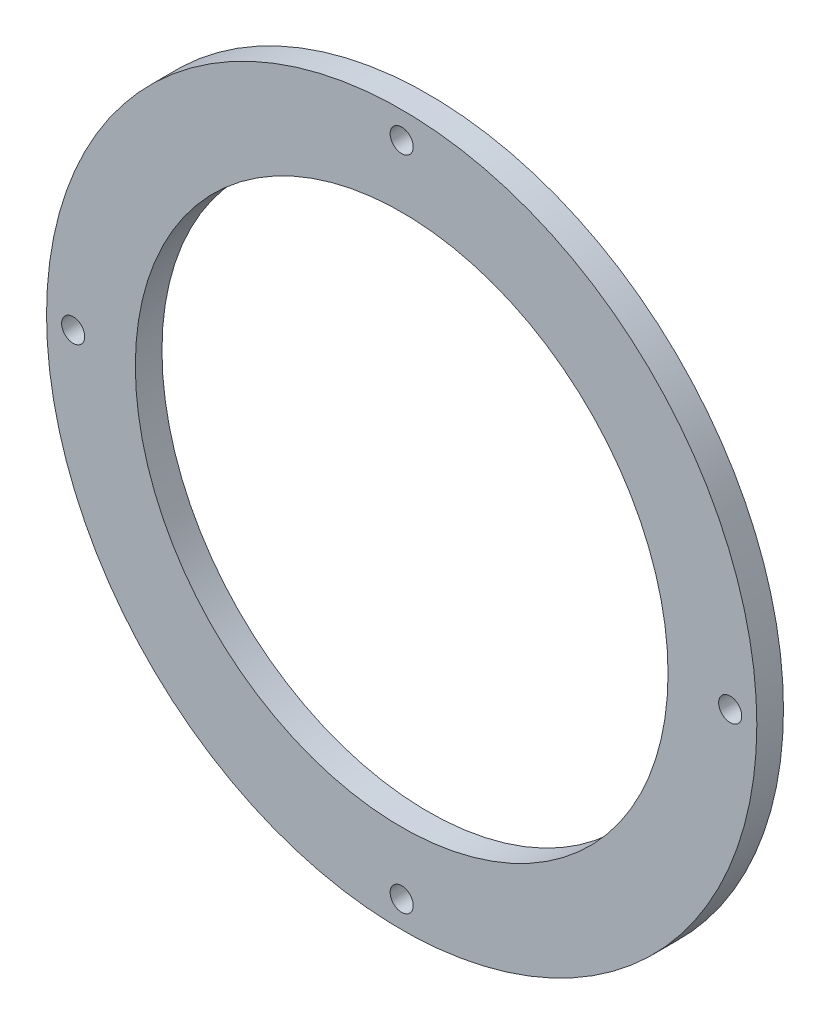
ISO-10303-21;
HEADER;
FILE_DESCRIPTION(('STEP AP214'),'2;1');
FILE_NAME('part.step','',(''),(''),'','','');
FILE_SCHEMA(('AUTOMOTIVE_DESIGN { 1 0 10303 214 1 1 1 1 }'));
ENDSEC;
DATA;
#1=APPLICATION_CONTEXT('core data for automotive mechanical design processes');
#2=APPLICATION_PROTOCOL_DEFINITION('international standard','automotive_design',2000,#1);
#3=PRODUCT_CONTEXT('',#1,'mechanical');
#4=PRODUCT('Part','Part','',(#3));
#5=PRODUCT_RELATED_PRODUCT_CATEGORY('part','',(#4));
#6=PRODUCT_DEFINITION_FORMATION('','',#4);
#7=PRODUCT_DEFINITION_CONTEXT('part definition',#1,'design');
#8=PRODUCT_DEFINITION('design','',#6,#7);
#9=PRODUCT_DEFINITION_SHAPE('','',#8);
#10=(LENGTH_UNIT() NAMED_UNIT(*) SI_UNIT(.MILLI.,.METRE.));
#11=(NAMED_UNIT(*) PLANE_ANGLE_UNIT() SI_UNIT($,.RADIAN.));
#12=(NAMED_UNIT(*) SI_UNIT($,.STERADIAN.) SOLID_ANGLE_UNIT());
#13=UNCERTAINTY_MEASURE_WITH_UNIT(LENGTH_MEASURE(1.E-05),#10,'distance_accuracy_value','');
#14=(GEOMETRIC_REPRESENTATION_CONTEXT(3) GLOBAL_UNCERTAINTY_ASSIGNED_CONTEXT((#13)) GLOBAL_UNIT_ASSIGNED_CONTEXT((#10,
#11,#12)) REPRESENTATION_CONTEXT('',''));
#15=CARTESIAN_POINT('',(0.,0.,0.));
#16=DIRECTION('',(0.,0.,1.));
#17=DIRECTION('',(1.,0.,0.));
#18=AXIS2_PLACEMENT_3D('',#15,#16,#17);
#19=CARTESIAN_POINT('',(0.,0.,3.));
#20=DIRECTION('',(0.,0.,-1.));
#21=DIRECTION('',(-1.,0.,0.));
#22=AXIS2_PLACEMENT_3D('',#19,#20,#21);
#23=CYLINDRICAL_SURFACE('',#22,40.);
#24=CARTESIAN_POINT('',(0.,0.,3.));
#25=DIRECTION('',(0.,0.,1.));
#26=DIRECTION('',(1.,0.,0.));
#27=AXIS2_PLACEMENT_3D('',#24,#25,#26);
#28=CIRCLE('',#27,40.);
#29=CARTESIAN_POINT('',(40.,0.,3.));
#30=VERTEX_POINT('',#29);
#31=EDGE_CURVE('E10',#30,#30,#28,.T.);
#32=ORIENTED_EDGE('',*,*,#31,.F.);
#33=EDGE_LOOP('',(#32));
#34=FACE_BOUND('',#33,.T.);
#35=CARTESIAN_POINT('',(0.,0.,0.));
#36=DIRECTION('',(0.,0.,1.));
#37=DIRECTION('',(1.,0.,0.));
#38=AXIS2_PLACEMENT_3D('',#35,#36,#37);
#39=CIRCLE('',#38,40.);
#40=CARTESIAN_POINT('',(40.,0.,0.));
#41=VERTEX_POINT('',#40);
#42=EDGE_CURVE('E36',#41,#41,#39,.T.);
#43=ORIENTED_EDGE('',*,*,#42,.T.);
#44=EDGE_LOOP('',(#43));
#45=FACE_BOUND('',#44,.T.);
#46=ADVANCED_FACE('F33',(#34,#45),#23,.T.);
#47=CARTESIAN_POINT('',(0.,0.,3.));
#48=DIRECTION('',(0.,0.,1.));
#49=DIRECTION('',(1.,0.,0.));
#50=AXIS2_PLACEMENT_3D('',#47,#48,#49);
#51=PLANE('',#50);
#52=CARTESIAN_POINT('',(0.,0.,3.));
#53=DIRECTION('',(0.,0.,1.));
#54=DIRECTION('',(1.,0.,0.));
#55=AXIS2_PLACEMENT_3D('',#52,#53,#54);
#56=CIRCLE('',#55,30.);
#57=CARTESIAN_POINT('',(30.,0.,3.));
#58=VERTEX_POINT('',#57);
#59=EDGE_CURVE('E68',#58,#58,#56,.T.);
#60=ORIENTED_EDGE('',*,*,#59,.F.);
#61=EDGE_LOOP('',(#60));
#62=FACE_BOUND('',#61,.T.);
#63=CARTESIAN_POINT('',(37.,3.87554428611588E-13,3.));
#64=DIRECTION('',(0.,0.,-1.));
#65=DIRECTION('',(-1.,0.,0.));
#66=AXIS2_PLACEMENT_3D('',#63,#64,#65);
#67=CIRCLE('',#66,1.3);
#68=CARTESIAN_POINT('',(35.7,3.87554428611588E-13,3.));
#69=VERTEX_POINT('',#68);
#70=EDGE_CURVE('E62',#69,#69,#67,.T.);
#71=ORIENTED_EDGE('',*,*,#70,.T.);
#72=EDGE_LOOP('',(#71));
#73=FACE_BOUND('',#72,.T.);
#74=CARTESIAN_POINT('',(0.,-37.,3.));
#75=DIRECTION('',(0.,0.,-1.));
#76=DIRECTION('',(-1.,0.,0.));
#77=AXIS2_PLACEMENT_3D('',#74,#75,#76);
#78=CIRCLE('',#77,1.3);
#79=CARTESIAN_POINT('',(-1.3,-37.,3.));
#80=VERTEX_POINT('',#79);
#81=EDGE_CURVE('E56',#80,#80,#78,.T.);
#82=ORIENTED_EDGE('',*,*,#81,.T.);
#83=EDGE_LOOP('',(#82));
#84=FACE_BOUND('',#83,.T.);
#85=CARTESIAN_POINT('',(-37.,-1.29184809537196E-13,3.));
#86=DIRECTION('',(0.,0.,-1.));
#87=DIRECTION('',(-1.,0.,0.));
#88=AXIS2_PLACEMENT_3D('',#85,#86,#87);
#89=CIRCLE('',#88,1.3);
#90=CARTESIAN_POINT('',(-38.3,-1.29184809537196E-13,3.));
#91=VERTEX_POINT('',#90);
#92=EDGE_CURVE('E50',#91,#91,#89,.T.);
#93=ORIENTED_EDGE('',*,*,#92,.T.);
#94=EDGE_LOOP('',(#93));
#95=FACE_BOUND('',#94,.T.);
#96=CARTESIAN_POINT('',(0.,37.,3.));
#97=DIRECTION('',(0.,0.,-1.));
#98=DIRECTION('',(-1.,0.,0.));
#99=AXIS2_PLACEMENT_3D('',#96,#97,#98);
#100=CIRCLE('',#99,1.3);
#101=CARTESIAN_POINT('',(-1.3,37.,3.));
#102=VERTEX_POINT('',#101);
#103=EDGE_CURVE('E43',#102,#102,#100,.T.);
#104=ORIENTED_EDGE('',*,*,#103,.T.);
#105=EDGE_LOOP('',(#104));
#106=FACE_BOUND('',#105,.T.);
#107=ORIENTED_EDGE('',*,*,#31,.T.);
#108=EDGE_LOOP('',(#107));
#109=FACE_BOUND('',#108,.T.);
#110=ADVANCED_FACE('F81',(#62,#73,#84,#95,#106,#109),#51,.T.);
#111=CARTESIAN_POINT('',(0.,0.,0.));
#112=DIRECTION('',(0.,0.,1.));
#113=DIRECTION('',(1.,0.,0.));
#114=AXIS2_PLACEMENT_3D('',#111,#112,#113);
#115=PLANE('',#114);
#116=CARTESIAN_POINT('',(0.,0.,0.));
#117=DIRECTION('',(0.,0.,-1.));
#118=DIRECTION('',(-1.,0.,0.));
#119=AXIS2_PLACEMENT_3D('',#116,#117,#118);
#120=CIRCLE('',#119,30.);
#121=CARTESIAN_POINT('',(-30.,0.,0.));
#122=VERTEX_POINT('',#121);
#123=EDGE_CURVE('E71',#122,#122,#120,.T.);
#124=ORIENTED_EDGE('',*,*,#123,.F.);
#125=EDGE_LOOP('',(#124));
#126=FACE_BOUND('',#125,.T.);
#127=CARTESIAN_POINT('',(37.,3.87554428611588E-13,0.));
#128=DIRECTION('',(0.,0.,-1.));
#129=DIRECTION('',(-1.,0.,0.));
#130=AXIS2_PLACEMENT_3D('',#127,#128,#129);
#131=CIRCLE('',#130,1.3);
#132=CARTESIAN_POINT('',(35.7,3.87554428611588E-13,0.));
#133=VERTEX_POINT('',#132);
#134=EDGE_CURVE('E65',#133,#133,#131,.T.);
#135=ORIENTED_EDGE('',*,*,#134,.F.);
#136=EDGE_LOOP('',(#135));
#137=FACE_BOUND('',#136,.T.);
#138=CARTESIAN_POINT('',(0.,-37.,0.));
#139=DIRECTION('',(0.,0.,-1.));
#140=DIRECTION('',(-1.,0.,0.));
#141=AXIS2_PLACEMENT_3D('',#138,#139,#140);
#142=CIRCLE('',#141,1.3);
#143=CARTESIAN_POINT('',(-1.3,-37.,0.));
#144=VERTEX_POINT('',#143);
#145=EDGE_CURVE('E59',#144,#144,#142,.T.);
#146=ORIENTED_EDGE('',*,*,#145,.F.);
#147=EDGE_LOOP('',(#146));
#148=FACE_BOUND('',#147,.T.);
#149=CARTESIAN_POINT('',(-37.,-1.29184809537196E-13,0.));
#150=DIRECTION('',(0.,0.,-1.));
#151=DIRECTION('',(-1.,0.,0.));
#152=AXIS2_PLACEMENT_3D('',#149,#150,#151);
#153=CIRCLE('',#152,1.3);
#154=CARTESIAN_POINT('',(-38.3,-1.29184809537196E-13,0.));
#155=VERTEX_POINT('',#154);
#156=EDGE_CURVE('E53',#155,#155,#153,.T.);
#157=ORIENTED_EDGE('',*,*,#156,.F.);
#158=EDGE_LOOP('',(#157));
#159=FACE_BOUND('',#158,.T.);
#160=CARTESIAN_POINT('',(0.,37.,0.));
#161=DIRECTION('',(0.,0.,-1.));
#162=DIRECTION('',(-1.,0.,0.));
#163=AXIS2_PLACEMENT_3D('',#160,#161,#162);
#164=CIRCLE('',#163,1.3);
#165=CARTESIAN_POINT('',(-1.3,37.,0.));
#166=VERTEX_POINT('',#165);
#167=EDGE_CURVE('E47',#166,#166,#164,.T.);
#168=ORIENTED_EDGE('',*,*,#167,.F.);
#169=EDGE_LOOP('',(#168));
#170=FACE_BOUND('',#169,.T.);
#171=ORIENTED_EDGE('',*,*,#42,.F.);
#172=EDGE_LOOP('',(#171));
#173=FACE_BOUND('',#172,.T.);
#174=ADVANCED_FACE('F77',(#126,#137,#148,#159,#170,#173),#115,.F.);
#175=CARTESIAN_POINT('',(0.,37.,0.));
#176=DIRECTION('',(0.,0.,-1.));
#177=DIRECTION('',(-1.,0.,0.));
#178=AXIS2_PLACEMENT_3D('',#175,#176,#177);
#179=CYLINDRICAL_SURFACE('',#178,1.3);
#180=ORIENTED_EDGE('',*,*,#103,.F.);
#181=EDGE_LOOP('',(#180));
#182=FACE_BOUND('',#181,.T.);
#183=ORIENTED_EDGE('',*,*,#167,.T.);
#184=EDGE_LOOP('',(#183));
#185=FACE_BOUND('',#184,.T.);
#186=ADVANCED_FACE('F80',(#182,#185),#179,.F.);
#187=CARTESIAN_POINT('',(-37.,-1.29184809537196E-13,0.));
#188=DIRECTION('',(0.,0.,-1.));
#189=DIRECTION('',(-1.,0.,0.));
#190=AXIS2_PLACEMENT_3D('',#187,#188,#189);
#191=CYLINDRICAL_SURFACE('',#190,1.3);
#192=ORIENTED_EDGE('',*,*,#92,.F.);
#193=EDGE_LOOP('',(#192));
#194=FACE_BOUND('',#193,.T.);
#195=ORIENTED_EDGE('',*,*,#156,.T.);
#196=EDGE_LOOP('',(#195));
#197=FACE_BOUND('',#196,.T.);
#198=ADVANCED_FACE('F106',(#194,#197),#191,.F.);
#199=CARTESIAN_POINT('',(0.,-37.,0.));
#200=DIRECTION('',(0.,0.,-1.));
#201=DIRECTION('',(-1.,0.,0.));
#202=AXIS2_PLACEMENT_3D('',#199,#200,#201);
#203=CYLINDRICAL_SURFACE('',#202,1.3);
#204=ORIENTED_EDGE('',*,*,#81,.F.);
#205=EDGE_LOOP('',(#204));
#206=FACE_BOUND('',#205,.T.);
#207=ORIENTED_EDGE('',*,*,#145,.T.);
#208=EDGE_LOOP('',(#207));
#209=FACE_BOUND('',#208,.T.);
#210=ADVANCED_FACE('F110',(#206,#209),#203,.F.);
#211=CARTESIAN_POINT('',(37.,3.87554428611588E-13,0.));
#212=DIRECTION('',(0.,0.,-1.));
#213=DIRECTION('',(-1.,0.,0.));
#214=AXIS2_PLACEMENT_3D('',#211,#212,#213);
#215=CYLINDRICAL_SURFACE('',#214,1.3);
#216=ORIENTED_EDGE('',*,*,#70,.F.);
#217=EDGE_LOOP('',(#216));
#218=FACE_BOUND('',#217,.T.);
#219=ORIENTED_EDGE('',*,*,#134,.T.);
#220=EDGE_LOOP('',(#219));
#221=FACE_BOUND('',#220,.T.);
#222=ADVANCED_FACE('F114',(#218,#221),#215,.F.);
#223=CARTESIAN_POINT('',(0.,0.,10.));
#224=DIRECTION('',(0.,0.,-1.));
#225=DIRECTION('',(-1.,0.,0.));
#226=AXIS2_PLACEMENT_3D('',#223,#224,#225);
#227=CYLINDRICAL_SURFACE('',#226,30.);
#228=ORIENTED_EDGE('',*,*,#59,.T.);
#229=EDGE_LOOP('',(#228));
#230=FACE_BOUND('',#229,.T.);
#231=ORIENTED_EDGE('',*,*,#123,.T.);
#232=EDGE_LOOP('',(#231));
#233=FACE_BOUND('',#232,.T.);
#234=ADVANCED_FACE('F75',(#230,#233),#227,.F.);
#235=CLOSED_SHELL('',(#46,#110,#174,#186,#198,#210,#222,#234));
#236=MANIFOLD_SOLID_BREP('B2',#235);
#237=ADVANCED_BREP_SHAPE_REPRESENTATION('',(#18,#236),#14);
#238=SHAPE_DEFINITION_REPRESENTATION(#9,#237);
ENDSEC;
END-ISO-10303-21;
